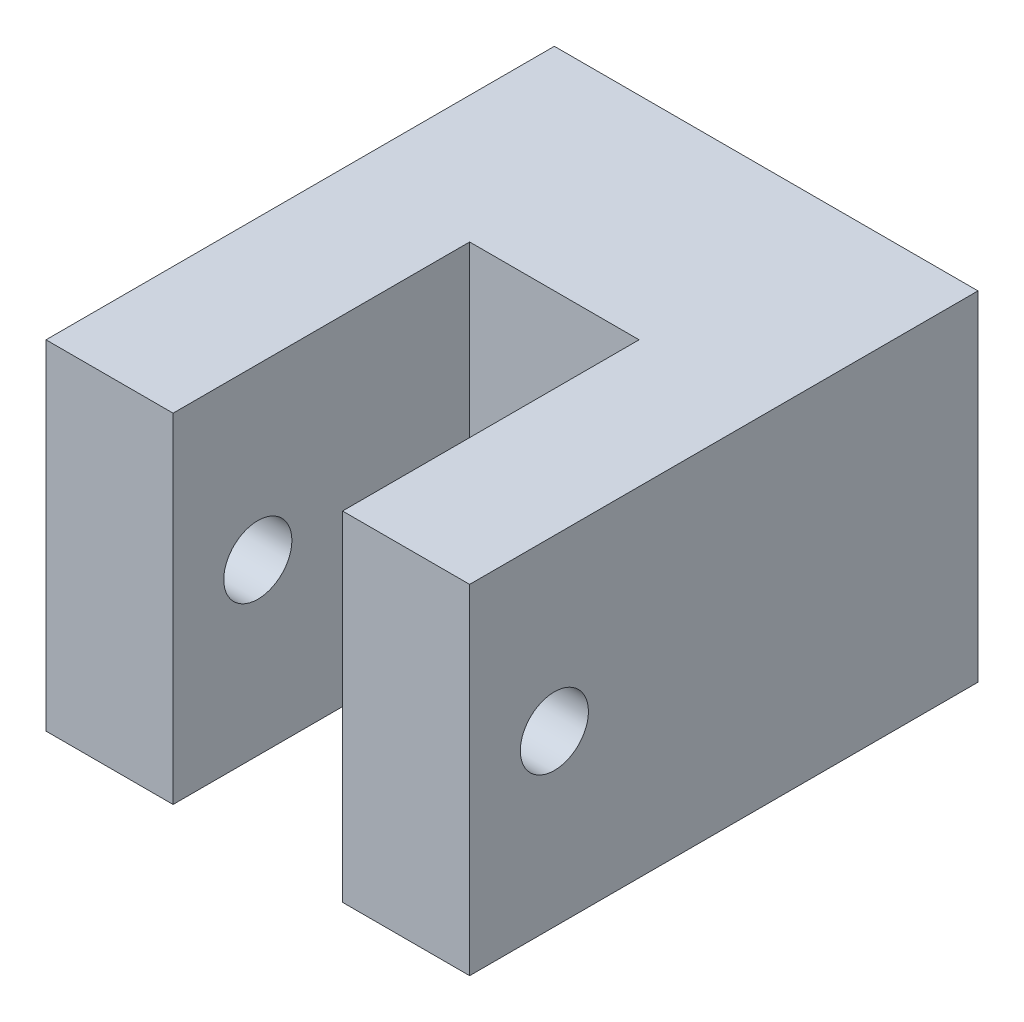
ISO-10303-21;
HEADER;
FILE_DESCRIPTION(('STEP AP214'),'2;1');
FILE_NAME('part.step','',(''),(''),'','','');
FILE_SCHEMA(('AUTOMOTIVE_DESIGN { 1 0 10303 214 1 1 1 1 }'));
ENDSEC;
DATA;
#1=APPLICATION_CONTEXT('core data for automotive mechanical design processes');
#2=APPLICATION_PROTOCOL_DEFINITION('international standard','automotive_design',2000,#1);
#3=PRODUCT_CONTEXT('',#1,'mechanical');
#4=PRODUCT('Part','Part','',(#3));
#5=PRODUCT_RELATED_PRODUCT_CATEGORY('part','',(#4));
#6=PRODUCT_DEFINITION_FORMATION('','',#4);
#7=PRODUCT_DEFINITION_CONTEXT('part definition',#1,'design');
#8=PRODUCT_DEFINITION('design','',#6,#7);
#9=PRODUCT_DEFINITION_SHAPE('','',#8);
#10=(LENGTH_UNIT() NAMED_UNIT(*) SI_UNIT(.MILLI.,.METRE.));
#11=(NAMED_UNIT(*) PLANE_ANGLE_UNIT() SI_UNIT($,.RADIAN.));
#12=(NAMED_UNIT(*) SI_UNIT($,.STERADIAN.) SOLID_ANGLE_UNIT());
#13=UNCERTAINTY_MEASURE_WITH_UNIT(LENGTH_MEASURE(1.E-05),#10,'distance_accuracy_value','');
#14=(GEOMETRIC_REPRESENTATION_CONTEXT(3) GLOBAL_UNCERTAINTY_ASSIGNED_CONTEXT((#13)) GLOBAL_UNIT_ASSIGNED_CONTEXT((#10,
#11,#12)) REPRESENTATION_CONTEXT('',''));
#15=CARTESIAN_POINT('',(0.,0.,0.));
#16=DIRECTION('',(0.,0.,1.));
#17=DIRECTION('',(1.,0.,0.));
#18=AXIS2_PLACEMENT_3D('',#15,#16,#17);
#19=CARTESIAN_POINT('',(0.,0.,38.1));
#20=DIRECTION('',(0.,0.,-1.));
#21=DIRECTION('',(-1.,0.,0.));
#22=AXIS2_PLACEMENT_3D('',#19,#20,#21);
#23=PLANE('',#22);
#24=DIRECTION('',(1.,0.,0.));
#25=VECTOR('',#24,1.);
#26=CARTESIAN_POINT('',(0.,0.,38.1));
#27=LINE('',#26,#25);
#28=CARTESIAN_POINT('',(0.,0.,38.1));
#29=VERTEX_POINT('',#28);
#30=CARTESIAN_POINT('',(9.525,0.,38.1));
#31=VERTEX_POINT('',#30);
#32=EDGE_CURVE('E94',#29,#31,#27,.T.);
#33=ORIENTED_EDGE('',*,*,#32,.T.);
#34=DIRECTION('',(0.,1.,0.));
#35=VECTOR('',#34,1.);
#36=CARTESIAN_POINT('',(9.525,0.,38.1));
#37=LINE('',#36,#35);
#38=CARTESIAN_POINT('',(9.525,25.4,38.1));
#39=VERTEX_POINT('',#38);
#40=EDGE_CURVE('E122',#31,#39,#37,.T.);
#41=ORIENTED_EDGE('',*,*,#40,.T.);
#42=DIRECTION('',(-1.,0.,0.));
#43=VECTOR('',#42,1.);
#44=CARTESIAN_POINT('',(0.,25.4,38.1));
#45=LINE('',#44,#43);
#46=CARTESIAN_POINT('',(0.,25.4,38.1));
#47=VERTEX_POINT('',#46);
#48=EDGE_CURVE('E65',#39,#47,#45,.T.);
#49=ORIENTED_EDGE('',*,*,#48,.T.);
#50=DIRECTION('',(0.,-1.,0.));
#51=VECTOR('',#50,1.);
#52=CARTESIAN_POINT('',(0.,0.,38.1));
#53=LINE('',#52,#51);
#54=EDGE_CURVE('E136',#47,#29,#53,.T.);
#55=ORIENTED_EDGE('',*,*,#54,.T.);
#56=EDGE_LOOP('',(#33,#41,#49,#55));
#57=FACE_BOUND('',#56,.T.);
#58=ADVANCED_FACE('F41',(#57),#23,.F.);
#59=CARTESIAN_POINT('',(0.,0.,38.1));
#60=DIRECTION('',(1.,0.,0.));
#61=DIRECTION('',(0.,0.,-1.));
#62=AXIS2_PLACEMENT_3D('',#59,#60,#61);
#63=PLANE('',#62);
#64=CARTESIAN_POINT('',(0.,12.7,31.75));
#65=DIRECTION('',(1.,0.,0.));
#66=DIRECTION('',(0.,0.,-1.));
#67=AXIS2_PLACEMENT_3D('',#64,#65,#66);
#68=CIRCLE('',#67,2.55269999999999);
#69=CARTESIAN_POINT('',(0.,12.7,29.1973));
#70=VERTEX_POINT('',#69);
#71=EDGE_CURVE('E263',#70,#70,#68,.T.);
#72=ORIENTED_EDGE('',*,*,#71,.T.);
#73=EDGE_LOOP('',(#72));
#74=FACE_BOUND('',#73,.T.);
#75=DIRECTION('',(0.,-1.,0.));
#76=VECTOR('',#75,1.);
#77=CARTESIAN_POINT('',(0.,0.,0.));
#78=LINE('',#77,#76);
#79=CARTESIAN_POINT('',(0.,25.4,0.));
#80=VERTEX_POINT('',#79);
#81=CARTESIAN_POINT('',(0.,0.,0.));
#82=VERTEX_POINT('',#81);
#83=EDGE_CURVE('E149',#80,#82,#78,.T.);
#84=ORIENTED_EDGE('',*,*,#83,.T.);
#85=DIRECTION('',(0.,0.,-1.));
#86=VECTOR('',#85,1.);
#87=CARTESIAN_POINT('',(0.,0.,38.1));
#88=LINE('',#87,#86);
#89=EDGE_CURVE('E11',#29,#82,#88,.T.);
#90=ORIENTED_EDGE('',*,*,#89,.F.);
#91=ORIENTED_EDGE('',*,*,#54,.F.);
#92=DIRECTION('',(0.,0.,-1.));
#93=VECTOR('',#92,1.);
#94=CARTESIAN_POINT('',(0.,25.4,38.1));
#95=LINE('',#94,#93);
#96=EDGE_CURVE('E148',#47,#80,#95,.T.);
#97=ORIENTED_EDGE('',*,*,#96,.T.);
#98=EDGE_LOOP('',(#84,#90,#91,#97));
#99=FACE_BOUND('',#98,.T.);
#100=ADVANCED_FACE('F43',(#74,#99),#63,.F.);
#101=CARTESIAN_POINT('',(0.,0.,38.1));
#102=DIRECTION('',(0.,1.,0.));
#103=DIRECTION('',(0.,0.,1.));
#104=AXIS2_PLACEMENT_3D('',#101,#102,#103);
#105=PLANE('',#104);
#106=DIRECTION('',(-1.,0.,0.));
#107=VECTOR('',#106,1.);
#108=CARTESIAN_POINT('',(9.525,0.,15.875));
#109=LINE('',#108,#107);
#110=CARTESIAN_POINT('',(22.225,0.,15.875));
#111=VERTEX_POINT('',#110);
#112=CARTESIAN_POINT('',(9.525,0.,15.875));
#113=VERTEX_POINT('',#112);
#114=EDGE_CURVE('E129',#111,#113,#109,.T.);
#115=ORIENTED_EDGE('',*,*,#114,.T.);
#116=DIRECTION('',(0.,0.,1.));
#117=VECTOR('',#116,1.);
#118=CARTESIAN_POINT('',(9.525,0.,38.1));
#119=LINE('',#118,#117);
#120=EDGE_CURVE('E124',#113,#31,#119,.T.);
#121=ORIENTED_EDGE('',*,*,#120,.T.);
#122=ORIENTED_EDGE('',*,*,#32,.F.);
#123=ORIENTED_EDGE('',*,*,#89,.T.);
#124=DIRECTION('',(1.,0.,0.));
#125=VECTOR('',#124,1.);
#126=CARTESIAN_POINT('',(0.,0.,0.));
#127=LINE('',#126,#125);
#128=CARTESIAN_POINT('',(31.75,0.,0.));
#129=VERTEX_POINT('',#128);
#130=EDGE_CURVE('E152',#82,#129,#127,.T.);
#131=ORIENTED_EDGE('',*,*,#130,.T.);
#132=DIRECTION('',(0.,0.,-1.));
#133=VECTOR('',#132,1.);
#134=CARTESIAN_POINT('',(31.75,0.,38.1));
#135=LINE('',#134,#133);
#136=CARTESIAN_POINT('',(31.75,0.,38.1));
#137=VERTEX_POINT('',#136);
#138=EDGE_CURVE('E49',#137,#129,#135,.T.);
#139=ORIENTED_EDGE('',*,*,#138,.F.);
#140=CARTESIAN_POINT('',(22.225,0.,38.1));
#141=VERTEX_POINT('',#140);
#142=EDGE_CURVE('E139',#141,#137,#27,.T.);
#143=ORIENTED_EDGE('',*,*,#142,.F.);
#144=DIRECTION('',(0.,0.,-1.));
#145=VECTOR('',#144,1.);
#146=CARTESIAN_POINT('',(22.225,0.,38.1));
#147=LINE('',#146,#145);
#148=EDGE_CURVE('E56',#141,#111,#147,.T.);
#149=ORIENTED_EDGE('',*,*,#148,.T.);
#150=EDGE_LOOP('',(#115,#121,#122,#123,#131,#139,#143,#149));
#151=FACE_BOUND('',#150,.T.);
#152=ADVANCED_FACE('F131',(#151),#105,.F.);
#153=CARTESIAN_POINT('',(31.75,0.,38.1));
#154=DIRECTION('',(-1.,0.,0.));
#155=DIRECTION('',(0.,0.,1.));
#156=AXIS2_PLACEMENT_3D('',#153,#154,#155);
#157=PLANE('',#156);
#158=CARTESIAN_POINT('',(31.75,12.7,31.75));
#159=DIRECTION('',(1.,0.,0.));
#160=DIRECTION('',(0.,0.,-1.));
#161=AXIS2_PLACEMENT_3D('',#158,#159,#160);
#162=CIRCLE('',#161,2.55269999999999);
#163=CARTESIAN_POINT('',(31.75,12.7,29.1973));
#164=VERTEX_POINT('',#163);
#165=EDGE_CURVE('E265',#164,#164,#162,.T.);
#166=ORIENTED_EDGE('',*,*,#165,.F.);
#167=EDGE_LOOP('',(#166));
#168=FACE_BOUND('',#167,.T.);
#169=DIRECTION('',(0.,1.,0.));
#170=VECTOR('',#169,1.);
#171=CARTESIAN_POINT('',(31.75,0.,0.));
#172=LINE('',#171,#170);
#173=CARTESIAN_POINT('',(31.75,25.4,0.));
#174=VERTEX_POINT('',#173);
#175=EDGE_CURVE('E155',#129,#174,#172,.T.);
#176=ORIENTED_EDGE('',*,*,#175,.T.);
#177=DIRECTION('',(0.,0.,-1.));
#178=VECTOR('',#177,1.);
#179=CARTESIAN_POINT('',(31.75,25.4,38.1));
#180=LINE('',#179,#178);
#181=CARTESIAN_POINT('',(31.75,25.4,38.1));
#182=VERTEX_POINT('',#181);
#183=EDGE_CURVE('E159',#182,#174,#180,.T.);
#184=ORIENTED_EDGE('',*,*,#183,.F.);
#185=DIRECTION('',(0.,1.,0.));
#186=VECTOR('',#185,1.);
#187=CARTESIAN_POINT('',(31.75,0.,38.1));
#188=LINE('',#187,#186);
#189=EDGE_CURVE('E138',#137,#182,#188,.T.);
#190=ORIENTED_EDGE('',*,*,#189,.F.);
#191=ORIENTED_EDGE('',*,*,#138,.T.);
#192=EDGE_LOOP('',(#176,#184,#190,#191));
#193=FACE_BOUND('',#192,.T.);
#194=ADVANCED_FACE('F165',(#168,#193),#157,.F.);
#195=CARTESIAN_POINT('',(0.,25.4,38.1));
#196=DIRECTION('',(0.,-1.,0.));
#197=DIRECTION('',(0.,0.,-1.));
#198=AXIS2_PLACEMENT_3D('',#195,#196,#197);
#199=PLANE('',#198);
#200=ORIENTED_EDGE('',*,*,#48,.F.);
#201=DIRECTION('',(0.,0.,1.));
#202=VECTOR('',#201,1.);
#203=CARTESIAN_POINT('',(9.525,25.4,38.1));
#204=LINE('',#203,#202);
#205=CARTESIAN_POINT('',(9.525,25.4,15.875));
#206=VERTEX_POINT('',#205);
#207=EDGE_CURVE('E127',#206,#39,#204,.T.);
#208=ORIENTED_EDGE('',*,*,#207,.F.);
#209=DIRECTION('',(-1.,0.,0.));
#210=VECTOR('',#209,1.);
#211=CARTESIAN_POINT('',(9.525,25.4,15.875));
#212=LINE('',#211,#210);
#213=CARTESIAN_POINT('',(22.225,25.4,15.875));
#214=VERTEX_POINT('',#213);
#215=EDGE_CURVE('E133',#214,#206,#212,.T.);
#216=ORIENTED_EDGE('',*,*,#215,.F.);
#217=DIRECTION('',(0.,0.,-1.));
#218=VECTOR('',#217,1.);
#219=CARTESIAN_POINT('',(22.225,25.4,38.1));
#220=LINE('',#219,#218);
#221=CARTESIAN_POINT('',(22.225,25.4,38.1));
#222=VERTEX_POINT('',#221);
#223=EDGE_CURVE('E176',#222,#214,#220,.T.);
#224=ORIENTED_EDGE('',*,*,#223,.F.);
#225=EDGE_CURVE('E145',#182,#222,#45,.T.);
#226=ORIENTED_EDGE('',*,*,#225,.F.);
#227=ORIENTED_EDGE('',*,*,#183,.T.);
#228=DIRECTION('',(-1.,0.,0.));
#229=VECTOR('',#228,1.);
#230=CARTESIAN_POINT('',(0.,25.4,0.));
#231=LINE('',#230,#229);
#232=EDGE_CURVE('E87',#174,#80,#231,.T.);
#233=ORIENTED_EDGE('',*,*,#232,.T.);
#234=ORIENTED_EDGE('',*,*,#96,.F.);
#235=EDGE_LOOP('',(#200,#208,#216,#224,#226,#227,#233,#234));
#236=FACE_BOUND('',#235,.T.);
#237=ADVANCED_FACE('F172',(#236),#199,.F.);
#238=ORIENTED_EDGE('',*,*,#225,.T.);
#239=DIRECTION('',(0.,1.,0.));
#240=VECTOR('',#239,1.);
#241=CARTESIAN_POINT('',(22.225,0.,38.1));
#242=LINE('',#241,#240);
#243=EDGE_CURVE('E128',#141,#222,#242,.T.);
#244=ORIENTED_EDGE('',*,*,#243,.F.);
#245=ORIENTED_EDGE('',*,*,#142,.T.);
#246=ORIENTED_EDGE('',*,*,#189,.T.);
#247=EDGE_LOOP('',(#238,#244,#245,#246));
#248=FACE_BOUND('',#247,.T.);
#249=ADVANCED_FACE('F214',(#248),#23,.F.);
#250=CARTESIAN_POINT('',(0.,0.,0.));
#251=DIRECTION('',(0.,0.,-1.));
#252=DIRECTION('',(-1.,0.,0.));
#253=AXIS2_PLACEMENT_3D('',#250,#251,#252);
#254=PLANE('',#253);
#255=CARTESIAN_POINT('',(25.4,12.7,0.));
#256=DIRECTION('',(0.,0.,-1.));
#257=DIRECTION('',(-1.,0.,0.));
#258=AXIS2_PLACEMENT_3D('',#255,#256,#257);
#259=CIRCLE('',#258,3.17499999999999);
#260=CARTESIAN_POINT('',(22.225,12.7,0.));
#261=VERTEX_POINT('',#260);
#262=EDGE_CURVE('E190',#261,#261,#259,.T.);
#263=ORIENTED_EDGE('',*,*,#262,.F.);
#264=EDGE_LOOP('',(#263));
#265=FACE_BOUND('',#264,.T.);
#266=CARTESIAN_POINT('',(6.35,12.7,0.));
#267=DIRECTION('',(0.,0.,-1.));
#268=DIRECTION('',(-1.,0.,0.));
#269=AXIS2_PLACEMENT_3D('',#266,#267,#268);
#270=CIRCLE('',#269,3.17499999999999);
#271=CARTESIAN_POINT('',(3.17500000000001,12.7,0.));
#272=VERTEX_POINT('',#271);
#273=EDGE_CURVE('E199',#272,#272,#270,.T.);
#274=ORIENTED_EDGE('',*,*,#273,.F.);
#275=EDGE_LOOP('',(#274));
#276=FACE_BOUND('',#275,.T.);
#277=ORIENTED_EDGE('',*,*,#83,.F.);
#278=ORIENTED_EDGE('',*,*,#232,.F.);
#279=ORIENTED_EDGE('',*,*,#175,.F.);
#280=ORIENTED_EDGE('',*,*,#130,.F.);
#281=EDGE_LOOP('',(#277,#278,#279,#280));
#282=FACE_BOUND('',#281,.T.);
#283=ADVANCED_FACE('F170',(#265,#276,#282),#254,.T.);
#284=CARTESIAN_POINT('',(6.35,12.7,12.7));
#285=DIRECTION('',(0.,0.,-1.));
#286=DIRECTION('',(-1.,0.,0.));
#287=AXIS2_PLACEMENT_3D('',#284,#285,#286);
#288=CONICAL_SURFACE('',#287,3.175,1.02974425867665);
#289=CARTESIAN_POINT('',(6.35,12.7,14.6077324654125));
#290=VERTEX_POINT('',#289);
#291=VERTEX_LOOP('',#290);
#292=FACE_BOUND('',#291,.T.);
#293=CARTESIAN_POINT('',(6.35,12.7,12.7));
#294=DIRECTION('',(0.,0.,-1.));
#295=DIRECTION('',(-1.,0.,0.));
#296=AXIS2_PLACEMENT_3D('',#293,#294,#295);
#297=CIRCLE('',#296,3.175);
#298=CARTESIAN_POINT('',(3.175,12.7,12.7));
#299=VERTEX_POINT('',#298);
#300=EDGE_CURVE('E153',#299,#299,#297,.T.);
#301=ORIENTED_EDGE('',*,*,#300,.T.);
#302=EDGE_LOOP('',(#301));
#303=FACE_BOUND('',#302,.T.);
#304=ADVANCED_FACE('F204',(#292,#303),#288,.F.);
#305=CARTESIAN_POINT('',(6.35,12.7,0.));
#306=DIRECTION('',(0.,0.,-1.));
#307=DIRECTION('',(-1.,0.,0.));
#308=AXIS2_PLACEMENT_3D('',#305,#306,#307);
#309=CYLINDRICAL_SURFACE('',#308,3.17499999999999);
#310=ORIENTED_EDGE('',*,*,#300,.F.);
#311=EDGE_LOOP('',(#310));
#312=FACE_BOUND('',#311,.T.);
#313=ORIENTED_EDGE('',*,*,#273,.T.);
#314=EDGE_LOOP('',(#313));
#315=FACE_BOUND('',#314,.T.);
#316=ADVANCED_FACE('F206',(#312,#315),#309,.F.);
#317=CARTESIAN_POINT('',(25.4,12.7,12.7));
#318=DIRECTION('',(0.,0.,-1.));
#319=DIRECTION('',(-1.,0.,0.));
#320=AXIS2_PLACEMENT_3D('',#317,#318,#319);
#321=CONICAL_SURFACE('',#320,3.175,1.02974425867665);
#322=CARTESIAN_POINT('',(25.4,12.7,14.6077324654125));
#323=VERTEX_POINT('',#322);
#324=VERTEX_LOOP('',#323);
#325=FACE_BOUND('',#324,.T.);
#326=CARTESIAN_POINT('',(25.4,12.7,12.7));
#327=DIRECTION('',(0.,0.,-1.));
#328=DIRECTION('',(-1.,0.,0.));
#329=AXIS2_PLACEMENT_3D('',#326,#327,#328);
#330=CIRCLE('',#329,3.175);
#331=CARTESIAN_POINT('',(22.225,12.7,12.7));
#332=VERTEX_POINT('',#331);
#333=EDGE_CURVE('E196',#332,#332,#330,.T.);
#334=ORIENTED_EDGE('',*,*,#333,.T.);
#335=EDGE_LOOP('',(#334));
#336=FACE_BOUND('',#335,.T.);
#337=ADVANCED_FACE('F209',(#325,#336),#321,.F.);
#338=CARTESIAN_POINT('',(25.4,12.7,0.));
#339=DIRECTION('',(0.,0.,-1.));
#340=DIRECTION('',(-1.,0.,0.));
#341=AXIS2_PLACEMENT_3D('',#338,#339,#340);
#342=CYLINDRICAL_SURFACE('',#341,3.17499999999999);
#343=ORIENTED_EDGE('',*,*,#333,.F.);
#344=EDGE_LOOP('',(#343));
#345=FACE_BOUND('',#344,.T.);
#346=ORIENTED_EDGE('',*,*,#262,.T.);
#347=EDGE_LOOP('',(#346));
#348=FACE_BOUND('',#347,.T.);
#349=ADVANCED_FACE('F237',(#345,#348),#342,.F.);
#350=CARTESIAN_POINT('',(9.525,0.,38.1));
#351=DIRECTION('',(-1.,0.,0.));
#352=DIRECTION('',(0.,0.,1.));
#353=AXIS2_PLACEMENT_3D('',#350,#351,#352);
#354=PLANE('',#353);
#355=CARTESIAN_POINT('',(9.525,12.7,31.75));
#356=DIRECTION('',(-1.,0.,0.));
#357=DIRECTION('',(0.,0.,1.));
#358=AXIS2_PLACEMENT_3D('',#355,#356,#357);
#359=CIRCLE('',#358,2.55269999999999);
#360=CARTESIAN_POINT('',(9.525,12.7,34.3027));
#361=VERTEX_POINT('',#360);
#362=EDGE_CURVE('E177',#361,#361,#359,.T.);
#363=ORIENTED_EDGE('',*,*,#362,.T.);
#364=EDGE_LOOP('',(#363));
#365=FACE_BOUND('',#364,.T.);
#366=ORIENTED_EDGE('',*,*,#207,.T.);
#367=ORIENTED_EDGE('',*,*,#40,.F.);
#368=ORIENTED_EDGE('',*,*,#120,.F.);
#369=DIRECTION('',(0.,1.,0.));
#370=VECTOR('',#369,1.);
#371=CARTESIAN_POINT('',(9.525,0.,15.875));
#372=LINE('',#371,#370);
#373=EDGE_CURVE('E188',#113,#206,#372,.T.);
#374=ORIENTED_EDGE('',*,*,#373,.T.);
#375=EDGE_LOOP('',(#366,#367,#368,#374));
#376=FACE_BOUND('',#375,.T.);
#377=ADVANCED_FACE('F123',(#365,#376),#354,.F.);
#378=CARTESIAN_POINT('',(9.525,0.,15.875));
#379=DIRECTION('',(0.,0.,-1.));
#380=DIRECTION('',(-1.,0.,0.));
#381=AXIS2_PLACEMENT_3D('',#378,#379,#380);
#382=PLANE('',#381);
#383=ORIENTED_EDGE('',*,*,#215,.T.);
#384=ORIENTED_EDGE('',*,*,#373,.F.);
#385=ORIENTED_EDGE('',*,*,#114,.F.);
#386=DIRECTION('',(0.,1.,0.));
#387=VECTOR('',#386,1.);
#388=CARTESIAN_POINT('',(22.225,0.,15.875));
#389=LINE('',#388,#387);
#390=EDGE_CURVE('E191',#111,#214,#389,.T.);
#391=ORIENTED_EDGE('',*,*,#390,.T.);
#392=EDGE_LOOP('',(#383,#384,#385,#391));
#393=FACE_BOUND('',#392,.T.);
#394=ADVANCED_FACE('F243',(#393),#382,.F.);
#395=CARTESIAN_POINT('',(22.225,0.,38.1));
#396=DIRECTION('',(1.,0.,0.));
#397=DIRECTION('',(0.,0.,-1.));
#398=AXIS2_PLACEMENT_3D('',#395,#396,#397);
#399=PLANE('',#398);
#400=CARTESIAN_POINT('',(22.225,12.7,31.75));
#401=DIRECTION('',(1.,0.,0.));
#402=DIRECTION('',(0.,0.,-1.));
#403=AXIS2_PLACEMENT_3D('',#400,#401,#402);
#404=CIRCLE('',#403,2.55269999999999);
#405=CARTESIAN_POINT('',(22.225,12.7,29.1973));
#406=VERTEX_POINT('',#405);
#407=EDGE_CURVE('E182',#406,#406,#404,.T.);
#408=ORIENTED_EDGE('',*,*,#407,.T.);
#409=EDGE_LOOP('',(#408));
#410=FACE_BOUND('',#409,.T.);
#411=ORIENTED_EDGE('',*,*,#223,.T.);
#412=ORIENTED_EDGE('',*,*,#390,.F.);
#413=ORIENTED_EDGE('',*,*,#148,.F.);
#414=ORIENTED_EDGE('',*,*,#243,.T.);
#415=EDGE_LOOP('',(#411,#412,#413,#414));
#416=FACE_BOUND('',#415,.T.);
#417=ADVANCED_FACE('F245',(#410,#416),#399,.F.);
#418=CARTESIAN_POINT('',(31.75,12.7,31.75));
#419=DIRECTION('',(1.,0.,0.));
#420=DIRECTION('',(0.,0.,-1.));
#421=AXIS2_PLACEMENT_3D('',#418,#419,#420);
#422=CYLINDRICAL_SURFACE('',#421,2.55269999999999);
#423=ORIENTED_EDGE('',*,*,#165,.T.);
#424=EDGE_LOOP('',(#423));
#425=FACE_BOUND('',#424,.T.);
#426=ORIENTED_EDGE('',*,*,#407,.F.);
#427=EDGE_LOOP('',(#426));
#428=FACE_BOUND('',#427,.T.);
#429=ADVANCED_FACE('F248',(#425,#428),#422,.F.);
#430=ORIENTED_EDGE('',*,*,#71,.F.);
#431=EDGE_LOOP('',(#430));
#432=FACE_BOUND('',#431,.T.);
#433=ORIENTED_EDGE('',*,*,#362,.F.);
#434=EDGE_LOOP('',(#433));
#435=FACE_BOUND('',#434,.T.);
#436=ADVANCED_FACE('F253',(#432,#435),#422,.F.);
#437=CLOSED_SHELL('',(#58,#100,#152,#194,#237,#249,#283,#304,#316,#337,#349,#377,#394,#417,#429,#436));
#438=MANIFOLD_SOLID_BREP('B2',#437);
#439=ADVANCED_BREP_SHAPE_REPRESENTATION('',(#18,#438),#14);
#440=SHAPE_DEFINITION_REPRESENTATION(#9,#439);
ENDSEC;
END-ISO-10303-21;
